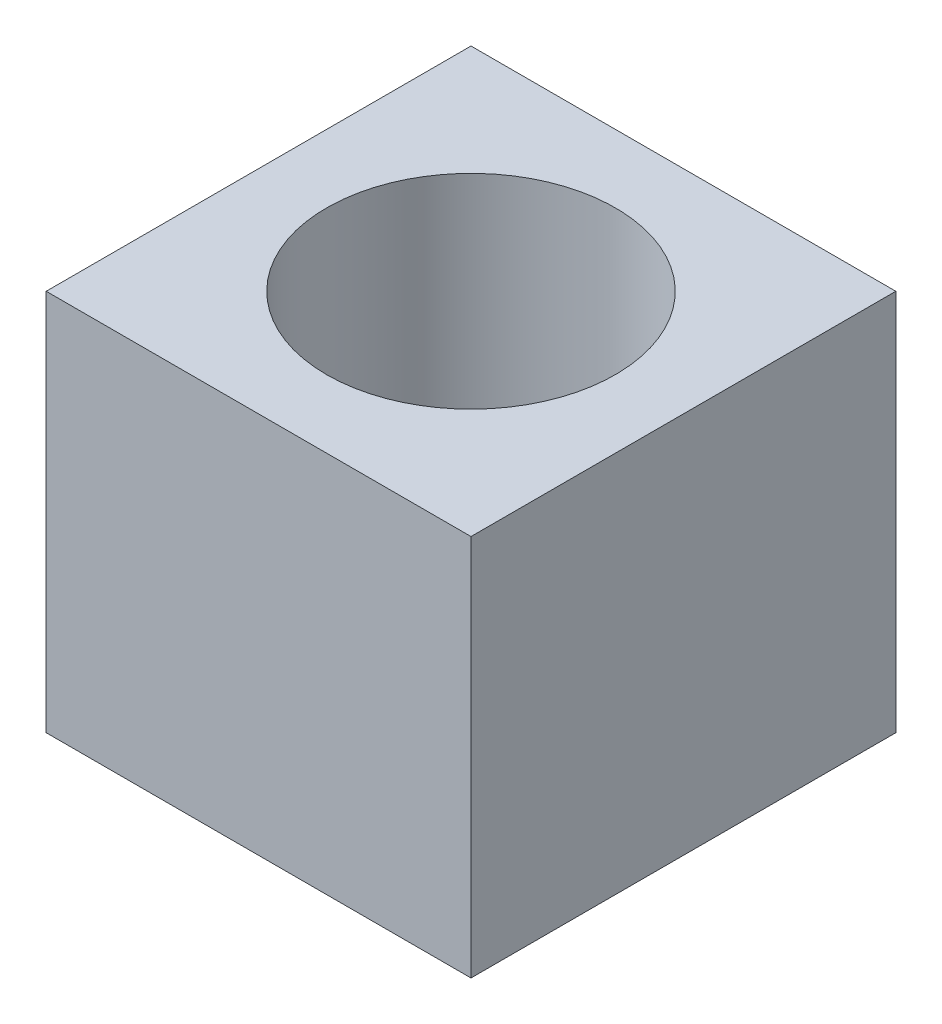
ISO-10303-21;
HEADER;
FILE_DESCRIPTION(('STEP AP214'),'2;1');
FILE_NAME('part.step','',(''),(''),'','','');
FILE_SCHEMA(('AUTOMOTIVE_DESIGN { 1 0 10303 214 1 1 1 1 }'));
ENDSEC;
DATA;
#1=APPLICATION_CONTEXT('core data for automotive mechanical design processes');
#2=APPLICATION_PROTOCOL_DEFINITION('international standard','automotive_design',2000,#1);
#3=PRODUCT_CONTEXT('',#1,'mechanical');
#4=PRODUCT('Part','Part','',(#3));
#5=PRODUCT_RELATED_PRODUCT_CATEGORY('part','',(#4));
#6=PRODUCT_DEFINITION_FORMATION('','',#4);
#7=PRODUCT_DEFINITION_CONTEXT('part definition',#1,'design');
#8=PRODUCT_DEFINITION('design','',#6,#7);
#9=PRODUCT_DEFINITION_SHAPE('','',#8);
#10=(LENGTH_UNIT() NAMED_UNIT(*) SI_UNIT(.MILLI.,.METRE.));
#11=(NAMED_UNIT(*) PLANE_ANGLE_UNIT() SI_UNIT($,.RADIAN.));
#12=(NAMED_UNIT(*) SI_UNIT($,.STERADIAN.) SOLID_ANGLE_UNIT());
#13=UNCERTAINTY_MEASURE_WITH_UNIT(LENGTH_MEASURE(1.E-05),#10,'distance_accuracy_value','');
#14=(GEOMETRIC_REPRESENTATION_CONTEXT(3) GLOBAL_UNCERTAINTY_ASSIGNED_CONTEXT((#13)) GLOBAL_UNIT_ASSIGNED_CONTEXT((#10,
#11,#12)) REPRESENTATION_CONTEXT('',''));
#15=CARTESIAN_POINT('',(0.,0.,0.));
#16=DIRECTION('',(0.,0.,1.));
#17=DIRECTION('',(1.,0.,0.));
#18=AXIS2_PLACEMENT_3D('',#15,#16,#17);
#19=CARTESIAN_POINT('',(0.,4.5,0.));
#20=DIRECTION('',(0.,-1.,0.));
#21=DIRECTION('',(0.,0.,-1.));
#22=AXIS2_PLACEMENT_3D('',#19,#20,#21);
#23=PLANE('',#22);
#24=DIRECTION('',(0.,0.,-1.));
#25=VECTOR('',#24,1.);
#26=CARTESIAN_POINT('',(2.5,4.5,2.5));
#27=LINE('',#26,#25);
#28=CARTESIAN_POINT('',(2.5,4.5,2.5));
#29=VERTEX_POINT('',#28);
#30=CARTESIAN_POINT('',(2.5,4.5,-2.5));
#31=VERTEX_POINT('',#30);
#32=EDGE_CURVE('E92',#29,#31,#27,.T.);
#33=ORIENTED_EDGE('',*,*,#32,.T.);
#34=DIRECTION('',(-1.,0.,0.));
#35=VECTOR('',#34,1.);
#36=CARTESIAN_POINT('',(-2.5,4.5,-2.5));
#37=LINE('',#36,#35);
#38=CARTESIAN_POINT('',(-2.5,4.5,-2.5));
#39=VERTEX_POINT('',#38);
#40=EDGE_CURVE('E87',#31,#39,#37,.T.);
#41=ORIENTED_EDGE('',*,*,#40,.T.);
#42=DIRECTION('',(0.,0.,1.));
#43=VECTOR('',#42,1.);
#44=CARTESIAN_POINT('',(-2.5,4.5,2.5));
#45=LINE('',#44,#43);
#46=CARTESIAN_POINT('',(-2.5,4.5,2.5));
#47=VERTEX_POINT('',#46);
#48=EDGE_CURVE('E90',#39,#47,#45,.T.);
#49=ORIENTED_EDGE('',*,*,#48,.T.);
#50=DIRECTION('',(1.,0.,0.));
#51=VECTOR('',#50,1.);
#52=CARTESIAN_POINT('',(-2.5,4.5,2.5));
#53=LINE('',#52,#51);
#54=EDGE_CURVE('E57',#47,#29,#53,.T.);
#55=ORIENTED_EDGE('',*,*,#54,.T.);
#56=EDGE_LOOP('',(#33,#41,#49,#55));
#57=FACE_BOUND('',#56,.T.);
#58=CARTESIAN_POINT('',(0.,4.5,0.));
#59=DIRECTION('',(0.,1.,0.));
#60=DIRECTION('',(0.,0.,1.));
#61=AXIS2_PLACEMENT_3D('',#58,#59,#60);
#62=CIRCLE('',#61,1.7);
#63=CARTESIAN_POINT('',(0.,4.5,1.7));
#64=VERTEX_POINT('',#63);
#65=EDGE_CURVE('E112',#64,#64,#62,.T.);
#66=ORIENTED_EDGE('',*,*,#65,.F.);
#67=EDGE_LOOP('',(#66));
#68=FACE_BOUND('',#67,.T.);
#69=ADVANCED_FACE('F39',(#57,#68),#23,.F.);
#70=CARTESIAN_POINT('',(0.,0.,0.));
#71=DIRECTION('',(0.,-1.,0.));
#72=DIRECTION('',(0.,0.,-1.));
#73=AXIS2_PLACEMENT_3D('',#70,#71,#72);
#74=PLANE('',#73);
#75=DIRECTION('',(0.,0.,-1.));
#76=VECTOR('',#75,1.);
#77=CARTESIAN_POINT('',(2.5,0.,2.5));
#78=LINE('',#77,#76);
#79=CARTESIAN_POINT('',(2.5,0.,2.5));
#80=VERTEX_POINT('',#79);
#81=CARTESIAN_POINT('',(2.5,0.,-2.5));
#82=VERTEX_POINT('',#81);
#83=EDGE_CURVE('E108',#80,#82,#78,.T.);
#84=ORIENTED_EDGE('',*,*,#83,.F.);
#85=DIRECTION('',(1.,0.,0.));
#86=VECTOR('',#85,1.);
#87=CARTESIAN_POINT('',(-2.5,0.,2.5));
#88=LINE('',#87,#86);
#89=CARTESIAN_POINT('',(-2.5,0.,2.5));
#90=VERTEX_POINT('',#89);
#91=EDGE_CURVE('E80',#90,#80,#88,.T.);
#92=ORIENTED_EDGE('',*,*,#91,.F.);
#93=DIRECTION('',(0.,0.,1.));
#94=VECTOR('',#93,1.);
#95=CARTESIAN_POINT('',(-2.5,0.,2.5));
#96=LINE('',#95,#94);
#97=CARTESIAN_POINT('',(-2.5,0.,-2.5));
#98=VERTEX_POINT('',#97);
#99=EDGE_CURVE('E74',#98,#90,#96,.T.);
#100=ORIENTED_EDGE('',*,*,#99,.F.);
#101=DIRECTION('',(-1.,0.,0.));
#102=VECTOR('',#101,1.);
#103=CARTESIAN_POINT('',(-2.5,0.,-2.5));
#104=LINE('',#103,#102);
#105=EDGE_CURVE('E97',#82,#98,#104,.T.);
#106=ORIENTED_EDGE('',*,*,#105,.F.);
#107=EDGE_LOOP('',(#84,#92,#100,#106));
#108=FACE_BOUND('',#107,.T.);
#109=CARTESIAN_POINT('',(0.,0.,0.));
#110=DIRECTION('',(0.,1.,0.));
#111=DIRECTION('',(0.,0.,1.));
#112=AXIS2_PLACEMENT_3D('',#109,#110,#111);
#113=CIRCLE('',#112,1.7);
#114=CARTESIAN_POINT('',(0.,0.,1.7));
#115=VERTEX_POINT('',#114);
#116=EDGE_CURVE('E130',#115,#115,#113,.T.);
#117=ORIENTED_EDGE('',*,*,#116,.T.);
#118=EDGE_LOOP('',(#117));
#119=FACE_BOUND('',#118,.T.);
#120=ADVANCED_FACE('F125',(#108,#119),#74,.T.);
#121=CARTESIAN_POINT('',(2.5,4.5,2.5));
#122=DIRECTION('',(-1.,0.,0.));
#123=DIRECTION('',(0.,0.,1.));
#124=AXIS2_PLACEMENT_3D('',#121,#122,#123);
#125=PLANE('',#124);
#126=ORIENTED_EDGE('',*,*,#83,.T.);
#127=DIRECTION('',(0.,-1.,0.));
#128=VECTOR('',#127,1.);
#129=CARTESIAN_POINT('',(2.5,4.5,-2.5));
#130=LINE('',#129,#128);
#131=EDGE_CURVE('E11',#31,#82,#130,.T.);
#132=ORIENTED_EDGE('',*,*,#131,.F.);
#133=ORIENTED_EDGE('',*,*,#32,.F.);
#134=DIRECTION('',(0.,-1.,0.));
#135=VECTOR('',#134,1.);
#136=CARTESIAN_POINT('',(2.5,4.5,2.5));
#137=LINE('',#136,#135);
#138=EDGE_CURVE('E104',#29,#80,#137,.T.);
#139=ORIENTED_EDGE('',*,*,#138,.T.);
#140=EDGE_LOOP('',(#126,#132,#133,#139));
#141=FACE_BOUND('',#140,.T.);
#142=ADVANCED_FACE('F41',(#141),#125,.F.);
#143=CARTESIAN_POINT('',(-2.5,4.5,-2.5));
#144=DIRECTION('',(0.,0.,1.));
#145=DIRECTION('',(1.,0.,0.));
#146=AXIS2_PLACEMENT_3D('',#143,#144,#145);
#147=PLANE('',#146);
#148=ORIENTED_EDGE('',*,*,#105,.T.);
#149=DIRECTION('',(0.,-1.,0.));
#150=VECTOR('',#149,1.);
#151=CARTESIAN_POINT('',(-2.5,4.5,-2.5));
#152=LINE('',#151,#150);
#153=EDGE_CURVE('E49',#39,#98,#152,.T.);
#154=ORIENTED_EDGE('',*,*,#153,.F.);
#155=ORIENTED_EDGE('',*,*,#40,.F.);
#156=ORIENTED_EDGE('',*,*,#131,.T.);
#157=EDGE_LOOP('',(#148,#154,#155,#156));
#158=FACE_BOUND('',#157,.T.);
#159=ADVANCED_FACE('F96',(#158),#147,.F.);
#160=CARTESIAN_POINT('',(-2.5,4.5,2.5));
#161=DIRECTION('',(1.,0.,0.));
#162=DIRECTION('',(0.,0.,-1.));
#163=AXIS2_PLACEMENT_3D('',#160,#161,#162);
#164=PLANE('',#163);
#165=ORIENTED_EDGE('',*,*,#99,.T.);
#166=DIRECTION('',(0.,-1.,0.));
#167=VECTOR('',#166,1.);
#168=CARTESIAN_POINT('',(-2.5,4.5,2.5));
#169=LINE('',#168,#167);
#170=EDGE_CURVE('E99',#47,#90,#169,.T.);
#171=ORIENTED_EDGE('',*,*,#170,.F.);
#172=ORIENTED_EDGE('',*,*,#48,.F.);
#173=ORIENTED_EDGE('',*,*,#153,.T.);
#174=EDGE_LOOP('',(#165,#171,#172,#173));
#175=FACE_BOUND('',#174,.T.);
#176=ADVANCED_FACE('F100',(#175),#164,.F.);
#177=CARTESIAN_POINT('',(-2.5,4.5,2.5));
#178=DIRECTION('',(0.,0.,-1.));
#179=DIRECTION('',(-1.,0.,0.));
#180=AXIS2_PLACEMENT_3D('',#177,#178,#179);
#181=PLANE('',#180);
#182=ORIENTED_EDGE('',*,*,#91,.T.);
#183=ORIENTED_EDGE('',*,*,#138,.F.);
#184=ORIENTED_EDGE('',*,*,#54,.F.);
#185=ORIENTED_EDGE('',*,*,#170,.T.);
#186=EDGE_LOOP('',(#182,#183,#184,#185));
#187=FACE_BOUND('',#186,.T.);
#188=ADVANCED_FACE('F122',(#187),#181,.F.);
#189=CARTESIAN_POINT('',(0.,4.5,0.));
#190=DIRECTION('',(0.,-1.,0.));
#191=DIRECTION('',(0.,0.,-1.));
#192=AXIS2_PLACEMENT_3D('',#189,#190,#191);
#193=CYLINDRICAL_SURFACE('',#192,1.7);
#194=ORIENTED_EDGE('',*,*,#65,.T.);
#195=EDGE_LOOP('',(#194));
#196=FACE_BOUND('',#195,.T.);
#197=ORIENTED_EDGE('',*,*,#116,.F.);
#198=EDGE_LOOP('',(#197));
#199=FACE_BOUND('',#198,.T.);
#200=ADVANCED_FACE('F138',(#196,#199),#193,.F.);
#201=CLOSED_SHELL('',(#69,#120,#142,#159,#176,#188,#200));
#202=MANIFOLD_SOLID_BREP('B2',#201);
#203=ADVANCED_BREP_SHAPE_REPRESENTATION('',(#18,#202),#14);
#204=SHAPE_DEFINITION_REPRESENTATION(#9,#203);
ENDSEC;
END-ISO-10303-21;
